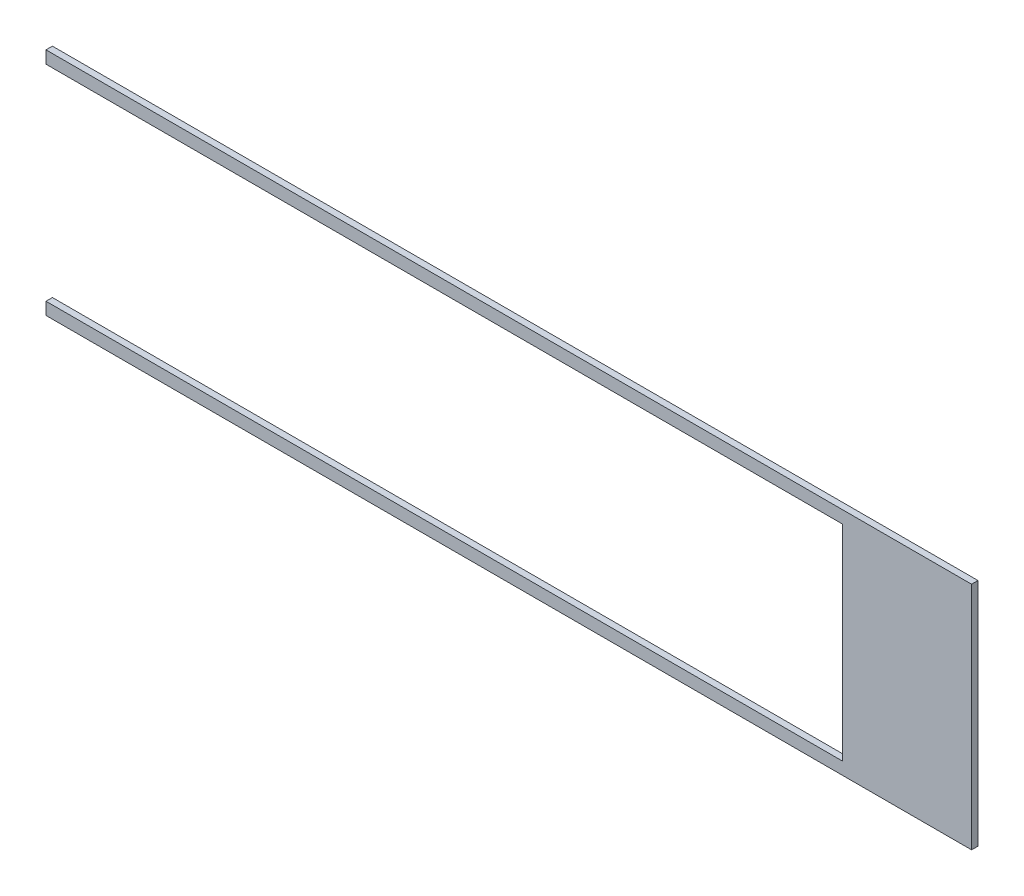
ISO-10303-21;
HEADER;
FILE_DESCRIPTION(('STEP AP214'),'2;1');
FILE_NAME('part.step','',(''),(''),'','','');
FILE_SCHEMA(('AUTOMOTIVE_DESIGN { 1 0 10303 214 1 1 1 1 }'));
ENDSEC;
DATA;
#1=APPLICATION_CONTEXT('core data for automotive mechanical design processes');
#2=APPLICATION_PROTOCOL_DEFINITION('international standard','automotive_design',2000,#1);
#3=PRODUCT_CONTEXT('',#1,'mechanical');
#4=PRODUCT('Part','Part','',(#3));
#5=PRODUCT_RELATED_PRODUCT_CATEGORY('part','',(#4));
#6=PRODUCT_DEFINITION_FORMATION('','',#4);
#7=PRODUCT_DEFINITION_CONTEXT('part definition',#1,'design');
#8=PRODUCT_DEFINITION('design','',#6,#7);
#9=PRODUCT_DEFINITION_SHAPE('','',#8);
#10=(LENGTH_UNIT() NAMED_UNIT(*) SI_UNIT(.MILLI.,.METRE.));
#11=(NAMED_UNIT(*) PLANE_ANGLE_UNIT() SI_UNIT($,.RADIAN.));
#12=(NAMED_UNIT(*) SI_UNIT($,.STERADIAN.) SOLID_ANGLE_UNIT());
#13=UNCERTAINTY_MEASURE_WITH_UNIT(LENGTH_MEASURE(1.E-05),#10,'distance_accuracy_value','');
#14=(GEOMETRIC_REPRESENTATION_CONTEXT(3) GLOBAL_UNCERTAINTY_ASSIGNED_CONTEXT((#13)) GLOBAL_UNIT_ASSIGNED_CONTEXT((#10,
#11,#12)) REPRESENTATION_CONTEXT('',''));
#15=CARTESIAN_POINT('',(0.,0.,0.));
#16=DIRECTION('',(0.,0.,1.));
#17=DIRECTION('',(1.,0.,0.));
#18=AXIS2_PLACEMENT_3D('',#15,#16,#17);
#19=CARTESIAN_POINT('',(-228.7016,-50.7492,3.175));
#20=DIRECTION('',(1.,0.,0.));
#21=DIRECTION('',(0.,0.,-1.));
#22=AXIS2_PLACEMENT_3D('',#19,#20,#21);
#23=PLANE('',#22);
#24=DIRECTION('',(0.,-1.,0.));
#25=VECTOR('',#24,1.);
#26=CARTESIAN_POINT('',(-228.7016,-50.7492,0.));
#27=LINE('',#26,#25);
#28=CARTESIAN_POINT('',(-228.7016,-50.7492,0.));
#29=VERTEX_POINT('',#28);
#30=CARTESIAN_POINT('',(-228.7016,-56.848375,0.));
#31=VERTEX_POINT('',#30);
#32=EDGE_CURVE('E140',#29,#31,#27,.T.);
#33=ORIENTED_EDGE('',*,*,#32,.T.);
#34=DIRECTION('',(0.,0.,-1.));
#35=VECTOR('',#34,1.);
#36=CARTESIAN_POINT('',(-228.7016,-56.848375,3.175));
#37=LINE('',#36,#35);
#38=CARTESIAN_POINT('',(-228.7016,-56.848375,3.175));
#39=VERTEX_POINT('',#38);
#40=EDGE_CURVE('E11',#39,#31,#37,.T.);
#41=ORIENTED_EDGE('',*,*,#40,.F.);
#42=DIRECTION('',(0.,-1.,0.));
#43=VECTOR('',#42,1.);
#44=CARTESIAN_POINT('',(-228.7016,-50.7492,3.175));
#45=LINE('',#44,#43);
#46=CARTESIAN_POINT('',(-228.7016,-50.7492,3.175));
#47=VERTEX_POINT('',#46);
#48=EDGE_CURVE('E162',#47,#39,#45,.T.);
#49=ORIENTED_EDGE('',*,*,#48,.F.);
#50=DIRECTION('',(0.,0.,-1.));
#51=VECTOR('',#50,1.);
#52=CARTESIAN_POINT('',(-228.7016,-50.7492,3.175));
#53=LINE('',#52,#51);
#54=EDGE_CURVE('E136',#47,#29,#53,.T.);
#55=ORIENTED_EDGE('',*,*,#54,.T.);
#56=EDGE_LOOP('',(#33,#41,#49,#55));
#57=FACE_BOUND('',#56,.T.);
#58=ADVANCED_FACE('F39',(#57),#23,.F.);
#59=CARTESIAN_POINT('',(-228.7016,-56.848375,3.175));
#60=DIRECTION('',(0.,1.,0.));
#61=DIRECTION('',(0.,0.,1.));
#62=AXIS2_PLACEMENT_3D('',#59,#60,#61);
#63=PLANE('',#62);
#64=DIRECTION('',(1.,0.,0.));
#65=VECTOR('',#64,1.);
#66=CARTESIAN_POINT('',(-228.7016,-56.848375,0.));
#67=LINE('',#66,#65);
#68=CARTESIAN_POINT('',(228.7016,-56.848375,0.));
#69=VERTEX_POINT('',#68);
#70=EDGE_CURVE('E144',#31,#69,#67,.T.);
#71=ORIENTED_EDGE('',*,*,#70,.T.);
#72=DIRECTION('',(0.,0.,-1.));
#73=VECTOR('',#72,1.);
#74=CARTESIAN_POINT('',(228.7016,-56.848375,3.175));
#75=LINE('',#74,#73);
#76=CARTESIAN_POINT('',(228.7016,-56.848375,3.175));
#77=VERTEX_POINT('',#76);
#78=EDGE_CURVE('E48',#77,#69,#75,.T.);
#79=ORIENTED_EDGE('',*,*,#78,.F.);
#80=DIRECTION('',(1.,0.,0.));
#81=VECTOR('',#80,1.);
#82=CARTESIAN_POINT('',(-228.7016,-56.848375,3.175));
#83=LINE('',#82,#81);
#84=EDGE_CURVE('E99',#39,#77,#83,.T.);
#85=ORIENTED_EDGE('',*,*,#84,.F.);
#86=ORIENTED_EDGE('',*,*,#40,.T.);
#87=EDGE_LOOP('',(#71,#79,#85,#86));
#88=FACE_BOUND('',#87,.T.);
#89=ADVANCED_FACE('F208',(#88),#63,.F.);
#90=CARTESIAN_POINT('',(228.7016,-56.848375,3.175));
#91=DIRECTION('',(-1.,0.,0.));
#92=DIRECTION('',(0.,0.,1.));
#93=AXIS2_PLACEMENT_3D('',#90,#91,#92);
#94=PLANE('',#93);
#95=DIRECTION('',(0.,1.,0.));
#96=VECTOR('',#95,1.);
#97=CARTESIAN_POINT('',(228.7016,-56.848375,0.));
#98=LINE('',#97,#96);
#99=CARTESIAN_POINT('',(228.7016,56.848375,0.));
#100=VERTEX_POINT('',#99);
#101=EDGE_CURVE('E147',#69,#100,#98,.T.);
#102=ORIENTED_EDGE('',*,*,#101,.T.);
#103=DIRECTION('',(0.,0.,-1.));
#104=VECTOR('',#103,1.);
#105=CARTESIAN_POINT('',(228.7016,56.848375,3.175));
#106=LINE('',#105,#104);
#107=CARTESIAN_POINT('',(228.7016,56.848375,3.175));
#108=VERTEX_POINT('',#107);
#109=EDGE_CURVE('E173',#108,#100,#106,.T.);
#110=ORIENTED_EDGE('',*,*,#109,.F.);
#111=DIRECTION('',(0.,1.,0.));
#112=VECTOR('',#111,1.);
#113=CARTESIAN_POINT('',(228.7016,-56.848375,3.175));
#114=LINE('',#113,#112);
#115=EDGE_CURVE('E183',#77,#108,#114,.T.);
#116=ORIENTED_EDGE('',*,*,#115,.F.);
#117=ORIENTED_EDGE('',*,*,#78,.T.);
#118=EDGE_LOOP('',(#102,#110,#116,#117));
#119=FACE_BOUND('',#118,.T.);
#120=ADVANCED_FACE('F181',(#119),#94,.F.);
#121=CARTESIAN_POINT('',(228.7016,56.848375,3.175));
#122=DIRECTION('',(0.,-1.,0.));
#123=DIRECTION('',(0.,0.,-1.));
#124=AXIS2_PLACEMENT_3D('',#121,#122,#123);
#125=PLANE('',#124);
#126=DIRECTION('',(-1.,0.,0.));
#127=VECTOR('',#126,1.);
#128=CARTESIAN_POINT('',(228.7016,56.848375,0.));
#129=LINE('',#128,#127);
#130=CARTESIAN_POINT('',(-228.7016,56.848375,0.));
#131=VERTEX_POINT('',#130);
#132=EDGE_CURVE('E150',#100,#131,#129,.T.);
#133=ORIENTED_EDGE('',*,*,#132,.T.);
#134=DIRECTION('',(0.,0.,-1.));
#135=VECTOR('',#134,1.);
#136=CARTESIAN_POINT('',(-228.7016,56.848375,3.175));
#137=LINE('',#136,#135);
#138=CARTESIAN_POINT('',(-228.7016,56.848375,3.175));
#139=VERTEX_POINT('',#138);
#140=EDGE_CURVE('E169',#139,#131,#137,.T.);
#141=ORIENTED_EDGE('',*,*,#140,.F.);
#142=DIRECTION('',(-1.,0.,0.));
#143=VECTOR('',#142,1.);
#144=CARTESIAN_POINT('',(228.7016,56.848375,3.175));
#145=LINE('',#144,#143);
#146=EDGE_CURVE('E196',#108,#139,#145,.T.);
#147=ORIENTED_EDGE('',*,*,#146,.F.);
#148=ORIENTED_EDGE('',*,*,#109,.T.);
#149=EDGE_LOOP('',(#133,#141,#147,#148));
#150=FACE_BOUND('',#149,.T.);
#151=ADVANCED_FACE('F191',(#150),#125,.F.);
#152=CARTESIAN_POINT('',(-228.7016,56.848375,3.175));
#153=DIRECTION('',(1.,0.,0.));
#154=DIRECTION('',(0.,0.,-1.));
#155=AXIS2_PLACEMENT_3D('',#152,#153,#154);
#156=PLANE('',#155);
#157=DIRECTION('',(0.,-1.,0.));
#158=VECTOR('',#157,1.);
#159=CARTESIAN_POINT('',(-228.7016,56.848375,0.));
#160=LINE('',#159,#158);
#161=CARTESIAN_POINT('',(-228.7016,50.6984,0.));
#162=VERTEX_POINT('',#161);
#163=EDGE_CURVE('E153',#131,#162,#160,.T.);
#164=ORIENTED_EDGE('',*,*,#163,.T.);
#165=DIRECTION('',(0.,0.,-1.));
#166=VECTOR('',#165,1.);
#167=CARTESIAN_POINT('',(-228.7016,50.6984,3.175));
#168=LINE('',#167,#166);
#169=CARTESIAN_POINT('',(-228.7016,50.6984,3.175));
#170=VERTEX_POINT('',#169);
#171=EDGE_CURVE('E129',#170,#162,#168,.T.);
#172=ORIENTED_EDGE('',*,*,#171,.F.);
#173=DIRECTION('',(0.,-1.,0.));
#174=VECTOR('',#173,1.);
#175=CARTESIAN_POINT('',(-228.7016,56.848375,3.175));
#176=LINE('',#175,#174);
#177=EDGE_CURVE('E118',#139,#170,#176,.T.);
#178=ORIENTED_EDGE('',*,*,#177,.F.);
#179=ORIENTED_EDGE('',*,*,#140,.T.);
#180=EDGE_LOOP('',(#164,#172,#178,#179));
#181=FACE_BOUND('',#180,.T.);
#182=ADVANCED_FACE('F194',(#181),#156,.F.);
#183=CARTESIAN_POINT('',(-228.7016,50.6984,3.175));
#184=DIRECTION('',(0.,1.,0.));
#185=DIRECTION('',(0.,0.,1.));
#186=AXIS2_PLACEMENT_3D('',#183,#184,#185);
#187=PLANE('',#186);
#188=DIRECTION('',(1.,0.,0.));
#189=VECTOR('',#188,1.);
#190=CARTESIAN_POINT('',(-228.7016,50.6984,0.));
#191=LINE('',#190,#189);
#192=CARTESIAN_POINT('',(164.9984,50.6984,0.));
#193=VERTEX_POINT('',#192);
#194=EDGE_CURVE('E127',#162,#193,#191,.T.);
#195=ORIENTED_EDGE('',*,*,#194,.T.);
#196=DIRECTION('',(0.,0.,-1.));
#197=VECTOR('',#196,1.);
#198=CARTESIAN_POINT('',(164.9984,50.6984,3.175));
#199=LINE('',#198,#197);
#200=CARTESIAN_POINT('',(164.9984,50.6984,3.175));
#201=VERTEX_POINT('',#200);
#202=EDGE_CURVE('E124',#201,#193,#199,.T.);
#203=ORIENTED_EDGE('',*,*,#202,.F.);
#204=DIRECTION('',(1.,0.,0.));
#205=VECTOR('',#204,1.);
#206=CARTESIAN_POINT('',(-228.7016,50.6984,3.175));
#207=LINE('',#206,#205);
#208=EDGE_CURVE('E112',#170,#201,#207,.T.);
#209=ORIENTED_EDGE('',*,*,#208,.F.);
#210=ORIENTED_EDGE('',*,*,#171,.T.);
#211=EDGE_LOOP('',(#195,#203,#209,#210));
#212=FACE_BOUND('',#211,.T.);
#213=ADVANCED_FACE('F125',(#212),#187,.F.);
#214=CARTESIAN_POINT('',(164.9984,50.6984,3.175));
#215=DIRECTION('',(1.,0.,0.));
#216=DIRECTION('',(0.,0.,-1.));
#217=AXIS2_PLACEMENT_3D('',#214,#215,#216);
#218=PLANE('',#217);
#219=DIRECTION('',(0.,-1.,0.));
#220=VECTOR('',#219,1.);
#221=CARTESIAN_POINT('',(164.9984,50.6984,0.));
#222=LINE('',#221,#220);
#223=CARTESIAN_POINT('',(164.9984,-50.7492,0.));
#224=VERTEX_POINT('',#223);
#225=EDGE_CURVE('E85',#193,#224,#222,.T.);
#226=ORIENTED_EDGE('',*,*,#225,.T.);
#227=DIRECTION('',(0.,0.,-1.));
#228=VECTOR('',#227,1.);
#229=CARTESIAN_POINT('',(164.9984,-50.7492,3.175));
#230=LINE('',#229,#228);
#231=CARTESIAN_POINT('',(164.9984,-50.7492,3.175));
#232=VERTEX_POINT('',#231);
#233=EDGE_CURVE('E130',#232,#224,#230,.T.);
#234=ORIENTED_EDGE('',*,*,#233,.F.);
#235=DIRECTION('',(0.,-1.,0.));
#236=VECTOR('',#235,1.);
#237=CARTESIAN_POINT('',(164.9984,50.6984,3.175));
#238=LINE('',#237,#236);
#239=EDGE_CURVE('E116',#201,#232,#238,.T.);
#240=ORIENTED_EDGE('',*,*,#239,.F.);
#241=ORIENTED_EDGE('',*,*,#202,.T.);
#242=EDGE_LOOP('',(#226,#234,#240,#241));
#243=FACE_BOUND('',#242,.T.);
#244=ADVANCED_FACE('F132',(#243),#218,.F.);
#245=CARTESIAN_POINT('',(164.9984,-50.7492,3.175));
#246=DIRECTION('',(0.,-1.,0.));
#247=DIRECTION('',(0.,0.,-1.));
#248=AXIS2_PLACEMENT_3D('',#245,#246,#247);
#249=PLANE('',#248);
#250=DIRECTION('',(-1.,0.,0.));
#251=VECTOR('',#250,1.);
#252=CARTESIAN_POINT('',(164.9984,-50.7492,0.));
#253=LINE('',#252,#251);
#254=EDGE_CURVE('E91',#224,#29,#253,.T.);
#255=ORIENTED_EDGE('',*,*,#254,.T.);
#256=ORIENTED_EDGE('',*,*,#54,.F.);
#257=DIRECTION('',(-1.,0.,0.));
#258=VECTOR('',#257,1.);
#259=CARTESIAN_POINT('',(164.9984,-50.7492,3.175));
#260=LINE('',#259,#258);
#261=EDGE_CURVE('E56',#232,#47,#260,.T.);
#262=ORIENTED_EDGE('',*,*,#261,.F.);
#263=ORIENTED_EDGE('',*,*,#233,.T.);
#264=EDGE_LOOP('',(#255,#256,#262,#263));
#265=FACE_BOUND('',#264,.T.);
#266=ADVANCED_FACE('F224',(#265),#249,.F.);
#267=CARTESIAN_POINT('',(0.,0.,3.175));
#268=DIRECTION('',(0.,0.,1.));
#269=DIRECTION('',(1.,0.,0.));
#270=AXIS2_PLACEMENT_3D('',#267,#268,#269);
#271=PLANE('',#270);
#272=ORIENTED_EDGE('',*,*,#48,.T.);
#273=ORIENTED_EDGE('',*,*,#84,.T.);
#274=ORIENTED_EDGE('',*,*,#115,.T.);
#275=ORIENTED_EDGE('',*,*,#146,.T.);
#276=ORIENTED_EDGE('',*,*,#177,.T.);
#277=ORIENTED_EDGE('',*,*,#208,.T.);
#278=ORIENTED_EDGE('',*,*,#239,.T.);
#279=ORIENTED_EDGE('',*,*,#261,.T.);
#280=EDGE_LOOP('',(#272,#273,#274,#275,#276,#277,#278,#279));
#281=FACE_BOUND('',#280,.T.);
#282=ADVANCED_FACE('F114',(#281),#271,.T.);
#283=CARTESIAN_POINT('',(0.,0.,0.));
#284=DIRECTION('',(0.,0.,1.));
#285=DIRECTION('',(1.,0.,0.));
#286=AXIS2_PLACEMENT_3D('',#283,#284,#285);
#287=PLANE('',#286);
#288=ORIENTED_EDGE('',*,*,#32,.F.);
#289=ORIENTED_EDGE('',*,*,#254,.F.);
#290=ORIENTED_EDGE('',*,*,#225,.F.);
#291=ORIENTED_EDGE('',*,*,#194,.F.);
#292=ORIENTED_EDGE('',*,*,#163,.F.);
#293=ORIENTED_EDGE('',*,*,#132,.F.);
#294=ORIENTED_EDGE('',*,*,#101,.F.);
#295=ORIENTED_EDGE('',*,*,#70,.F.);
#296=EDGE_LOOP('',(#288,#289,#290,#291,#292,#293,#294,#295));
#297=FACE_BOUND('',#296,.T.);
#298=ADVANCED_FACE('F187',(#297),#287,.F.);
#299=CLOSED_SHELL('',(#58,#89,#120,#151,#182,#213,#244,#266,#282,#298));
#300=MANIFOLD_SOLID_BREP('B2',#299);
#301=ADVANCED_BREP_SHAPE_REPRESENTATION('',(#18,#300),#14);
#302=SHAPE_DEFINITION_REPRESENTATION(#9,#301);
ENDSEC;
END-ISO-10303-21;
